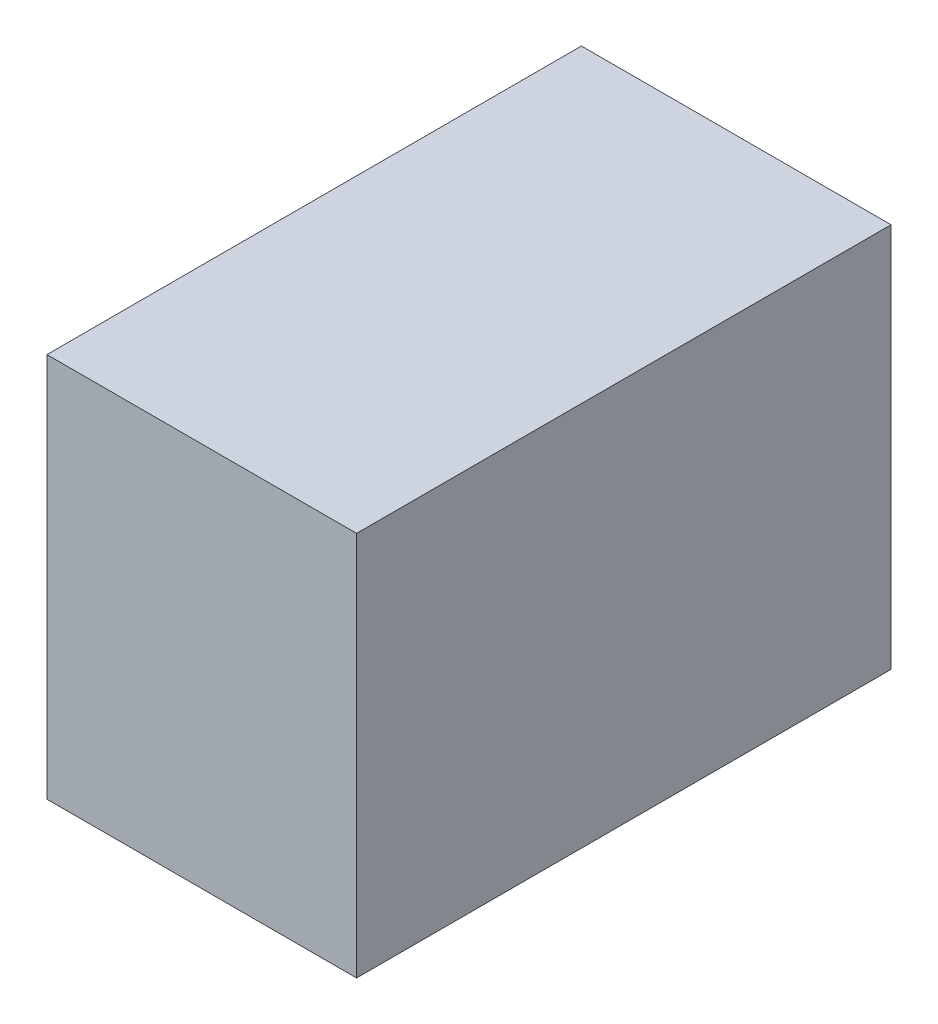
ISO-10303-21;
HEADER;
FILE_DESCRIPTION(('STEP AP214'),'2;1');
FILE_NAME('part.step','',(''),(''),'','','');
FILE_SCHEMA(('AUTOMOTIVE_DESIGN { 1 0 10303 214 1 1 1 1 }'));
ENDSEC;
DATA;
#1=APPLICATION_CONTEXT('core data for automotive mechanical design processes');
#2=APPLICATION_PROTOCOL_DEFINITION('international standard','automotive_design',2000,#1);
#3=PRODUCT_CONTEXT('',#1,'mechanical');
#4=PRODUCT('Part','Part','',(#3));
#5=PRODUCT_RELATED_PRODUCT_CATEGORY('part','',(#4));
#6=PRODUCT_DEFINITION_FORMATION('','',#4);
#7=PRODUCT_DEFINITION_CONTEXT('part definition',#1,'design');
#8=PRODUCT_DEFINITION('design','',#6,#7);
#9=PRODUCT_DEFINITION_SHAPE('','',#8);
#10=(LENGTH_UNIT() NAMED_UNIT(*) SI_UNIT(.MILLI.,.METRE.));
#11=(NAMED_UNIT(*) PLANE_ANGLE_UNIT() SI_UNIT($,.RADIAN.));
#12=(NAMED_UNIT(*) SI_UNIT($,.STERADIAN.) SOLID_ANGLE_UNIT());
#13=UNCERTAINTY_MEASURE_WITH_UNIT(LENGTH_MEASURE(1.E-05),#10,'distance_accuracy_value','');
#14=(GEOMETRIC_REPRESENTATION_CONTEXT(3) GLOBAL_UNCERTAINTY_ASSIGNED_CONTEXT((#13)) GLOBAL_UNIT_ASSIGNED_CONTEXT((#10,
#11,#12)) REPRESENTATION_CONTEXT('',''));
#15=CARTESIAN_POINT('',(0.,0.,0.));
#16=DIRECTION('',(0.,0.,1.));
#17=DIRECTION('',(1.,0.,0.));
#18=AXIS2_PLACEMENT_3D('',#15,#16,#17);
#19=CARTESIAN_POINT('',(201.02891192414,500.,347.014787507099));
#20=DIRECTION('',(-1.,0.,0.));
#21=DIRECTION('',(0.,0.,1.));
#22=AXIS2_PLACEMENT_3D('',#19,#20,#21);
#23=PLANE('',#22);
#24=DIRECTION('',(0.,0.,-1.));
#25=VECTOR('',#24,1.);
#26=CARTESIAN_POINT('',(201.02891192414,0.,347.014787507099));
#27=LINE('',#26,#25);
#28=CARTESIAN_POINT('',(201.02891192414,0.,347.014787507099));
#29=VERTEX_POINT('',#28);
#30=CARTESIAN_POINT('',(201.02891192414,0.,-347.0147875071));
#31=VERTEX_POINT('',#30);
#32=EDGE_CURVE('E100',#29,#31,#27,.T.);
#33=ORIENTED_EDGE('',*,*,#32,.T.);
#34=DIRECTION('',(0.,-1.,0.));
#35=VECTOR('',#34,1.);
#36=CARTESIAN_POINT('',(201.02891192414,500.,-347.0147875071));
#37=LINE('',#36,#35);
#38=CARTESIAN_POINT('',(201.02891192414,500.,-347.0147875071));
#39=VERTEX_POINT('',#38);
#40=EDGE_CURVE('E11',#39,#31,#37,.T.);
#41=ORIENTED_EDGE('',*,*,#40,.F.);
#42=DIRECTION('',(0.,0.,-1.));
#43=VECTOR('',#42,1.);
#44=CARTESIAN_POINT('',(201.02891192414,500.,347.014787507099));
#45=LINE('',#44,#43);
#46=CARTESIAN_POINT('',(201.02891192414,500.,347.014787507099));
#47=VERTEX_POINT('',#46);
#48=EDGE_CURVE('E88',#47,#39,#45,.T.);
#49=ORIENTED_EDGE('',*,*,#48,.F.);
#50=DIRECTION('',(0.,-1.,0.));
#51=VECTOR('',#50,1.);
#52=CARTESIAN_POINT('',(201.02891192414,500.,347.014787507099));
#53=LINE('',#52,#51);
#54=EDGE_CURVE('E96',#47,#29,#53,.T.);
#55=ORIENTED_EDGE('',*,*,#54,.T.);
#56=EDGE_LOOP('',(#33,#41,#49,#55));
#57=FACE_BOUND('',#56,.T.);
#58=ADVANCED_FACE('F37',(#57),#23,.F.);
#59=CARTESIAN_POINT('',(-201.02891192414,500.,-347.0147875071));
#60=DIRECTION('',(0.,0.,1.));
#61=DIRECTION('',(1.,0.,0.));
#62=AXIS2_PLACEMENT_3D('',#59,#60,#61);
#63=PLANE('',#62);
#64=DIRECTION('',(-1.,0.,0.));
#65=VECTOR('',#64,1.);
#66=CARTESIAN_POINT('',(-201.02891192414,0.,-347.0147875071));
#67=LINE('',#66,#65);
#68=CARTESIAN_POINT('',(-201.02891192414,0.,-347.0147875071));
#69=VERTEX_POINT('',#68);
#70=EDGE_CURVE('E92',#31,#69,#67,.T.);
#71=ORIENTED_EDGE('',*,*,#70,.T.);
#72=DIRECTION('',(0.,-1.,0.));
#73=VECTOR('',#72,1.);
#74=CARTESIAN_POINT('',(-201.02891192414,500.,-347.0147875071));
#75=LINE('',#74,#73);
#76=CARTESIAN_POINT('',(-201.02891192414,500.,-347.0147875071));
#77=VERTEX_POINT('',#76);
#78=EDGE_CURVE('E45',#77,#69,#75,.T.);
#79=ORIENTED_EDGE('',*,*,#78,.F.);
#80=DIRECTION('',(-1.,0.,0.));
#81=VECTOR('',#80,1.);
#82=CARTESIAN_POINT('',(-201.02891192414,500.,-347.0147875071));
#83=LINE('',#82,#81);
#84=EDGE_CURVE('E83',#39,#77,#83,.T.);
#85=ORIENTED_EDGE('',*,*,#84,.F.);
#86=ORIENTED_EDGE('',*,*,#40,.T.);
#87=EDGE_LOOP('',(#71,#79,#85,#86));
#88=FACE_BOUND('',#87,.T.);
#89=ADVANCED_FACE('F91',(#88),#63,.F.);
#90=CARTESIAN_POINT('',(-201.02891192414,500.,347.014787507099));
#91=DIRECTION('',(1.,0.,0.));
#92=DIRECTION('',(0.,0.,-1.));
#93=AXIS2_PLACEMENT_3D('',#90,#91,#92);
#94=PLANE('',#93);
#95=DIRECTION('',(0.,0.,1.));
#96=VECTOR('',#95,1.);
#97=CARTESIAN_POINT('',(-201.02891192414,0.,347.014787507099));
#98=LINE('',#97,#96);
#99=CARTESIAN_POINT('',(-201.02891192414,0.,347.014787507099));
#100=VERTEX_POINT('',#99);
#101=EDGE_CURVE('E70',#69,#100,#98,.T.);
#102=ORIENTED_EDGE('',*,*,#101,.T.);
#103=DIRECTION('',(0.,-1.,0.));
#104=VECTOR('',#103,1.);
#105=CARTESIAN_POINT('',(-201.02891192414,500.,347.014787507099));
#106=LINE('',#105,#104);
#107=CARTESIAN_POINT('',(-201.02891192414,500.,347.014787507099));
#108=VERTEX_POINT('',#107);
#109=EDGE_CURVE('E93',#108,#100,#106,.T.);
#110=ORIENTED_EDGE('',*,*,#109,.F.);
#111=DIRECTION('',(0.,0.,1.));
#112=VECTOR('',#111,1.);
#113=CARTESIAN_POINT('',(-201.02891192414,500.,347.014787507099));
#114=LINE('',#113,#112);
#115=EDGE_CURVE('E86',#77,#108,#114,.T.);
#116=ORIENTED_EDGE('',*,*,#115,.F.);
#117=ORIENTED_EDGE('',*,*,#78,.T.);
#118=EDGE_LOOP('',(#102,#110,#116,#117));
#119=FACE_BOUND('',#118,.T.);
#120=ADVANCED_FACE('F94',(#119),#94,.F.);
#121=CARTESIAN_POINT('',(-201.02891192414,500.,347.014787507099));
#122=DIRECTION('',(0.,0.,-1.));
#123=DIRECTION('',(-1.,0.,0.));
#124=AXIS2_PLACEMENT_3D('',#121,#122,#123);
#125=PLANE('',#124);
#126=DIRECTION('',(1.,0.,0.));
#127=VECTOR('',#126,1.);
#128=CARTESIAN_POINT('',(-201.02891192414,0.,347.014787507099));
#129=LINE('',#128,#127);
#130=EDGE_CURVE('E76',#100,#29,#129,.T.);
#131=ORIENTED_EDGE('',*,*,#130,.T.);
#132=ORIENTED_EDGE('',*,*,#54,.F.);
#133=DIRECTION('',(1.,0.,0.));
#134=VECTOR('',#133,1.);
#135=CARTESIAN_POINT('',(-201.02891192414,500.,347.014787507099));
#136=LINE('',#135,#134);
#137=EDGE_CURVE('E53',#108,#47,#136,.T.);
#138=ORIENTED_EDGE('',*,*,#137,.F.);
#139=ORIENTED_EDGE('',*,*,#109,.T.);
#140=EDGE_LOOP('',(#131,#132,#138,#139));
#141=FACE_BOUND('',#140,.T.);
#142=ADVANCED_FACE('F107',(#141),#125,.F.);
#143=CARTESIAN_POINT('',(0.,500.,0.));
#144=DIRECTION('',(0.,-1.,0.));
#145=DIRECTION('',(0.,0.,-1.));
#146=AXIS2_PLACEMENT_3D('',#143,#144,#145);
#147=PLANE('',#146);
#148=ORIENTED_EDGE('',*,*,#48,.T.);
#149=ORIENTED_EDGE('',*,*,#84,.T.);
#150=ORIENTED_EDGE('',*,*,#115,.T.);
#151=ORIENTED_EDGE('',*,*,#137,.T.);
#152=EDGE_LOOP('',(#148,#149,#150,#151));
#153=FACE_BOUND('',#152,.T.);
#154=ADVANCED_FACE('F84',(#153),#147,.F.);
#155=CARTESIAN_POINT('',(0.,0.,0.));
#156=DIRECTION('',(0.,-1.,0.));
#157=DIRECTION('',(0.,0.,-1.));
#158=AXIS2_PLACEMENT_3D('',#155,#156,#157);
#159=PLANE('',#158);
#160=ORIENTED_EDGE('',*,*,#32,.F.);
#161=ORIENTED_EDGE('',*,*,#130,.F.);
#162=ORIENTED_EDGE('',*,*,#101,.F.);
#163=ORIENTED_EDGE('',*,*,#70,.F.);
#164=EDGE_LOOP('',(#160,#161,#162,#163));
#165=FACE_BOUND('',#164,.T.);
#166=ADVANCED_FACE('F110',(#165),#159,.T.);
#167=CLOSED_SHELL('',(#58,#89,#120,#142,#154,#166));
#168=MANIFOLD_SOLID_BREP('B2',#167);
#169=ADVANCED_BREP_SHAPE_REPRESENTATION('',(#18,#168),#14);
#170=SHAPE_DEFINITION_REPRESENTATION(#9,#169);
ENDSEC;
END-ISO-10303-21;
